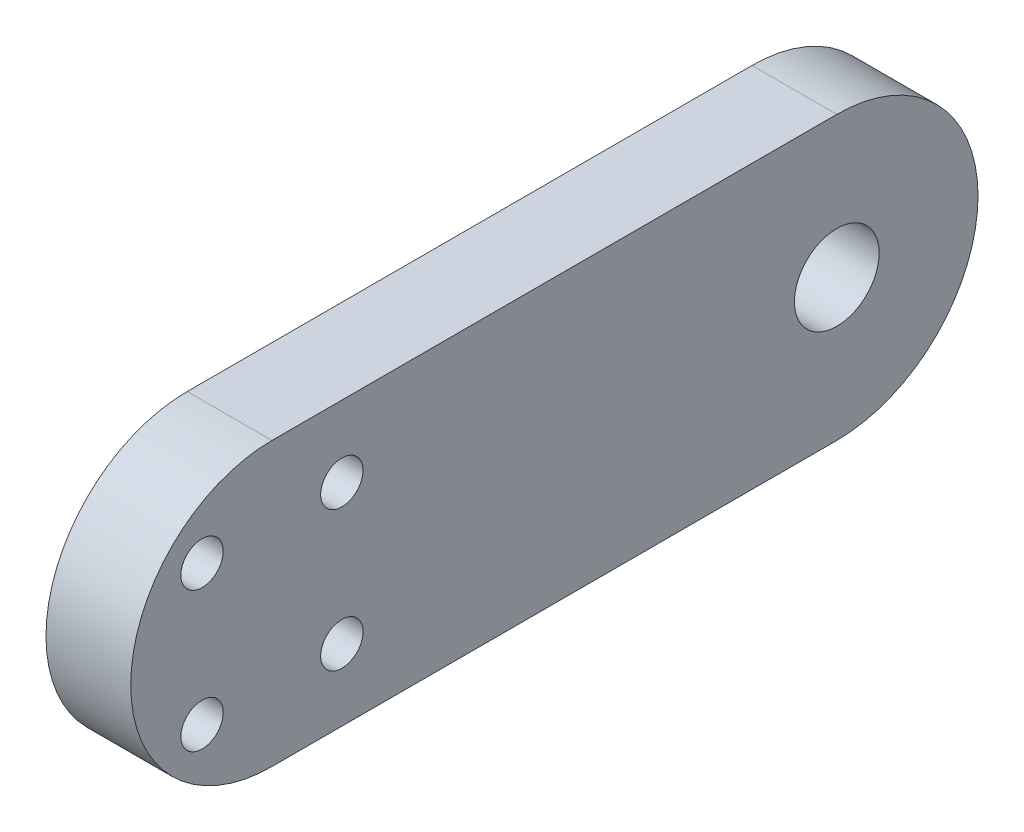
ISO-10303-21;
HEADER;
FILE_DESCRIPTION(('STEP AP214'),'2;1');
FILE_NAME('part.step','',(''),(''),'','','');
FILE_SCHEMA(('AUTOMOTIVE_DESIGN { 1 0 10303 214 1 1 1 1 }'));
ENDSEC;
DATA;
#1=APPLICATION_CONTEXT('core data for automotive mechanical design processes');
#2=APPLICATION_PROTOCOL_DEFINITION('international standard','automotive_design',2000,#1);
#3=PRODUCT_CONTEXT('',#1,'mechanical');
#4=PRODUCT('Part','Part','',(#3));
#5=PRODUCT_RELATED_PRODUCT_CATEGORY('part','',(#4));
#6=PRODUCT_DEFINITION_FORMATION('','',#4);
#7=PRODUCT_DEFINITION_CONTEXT('part definition',#1,'design');
#8=PRODUCT_DEFINITION('design','',#6,#7);
#9=PRODUCT_DEFINITION_SHAPE('','',#8);
#10=(LENGTH_UNIT() NAMED_UNIT(*) SI_UNIT(.MILLI.,.METRE.));
#11=(NAMED_UNIT(*) PLANE_ANGLE_UNIT() SI_UNIT($,.RADIAN.));
#12=(NAMED_UNIT(*) SI_UNIT($,.STERADIAN.) SOLID_ANGLE_UNIT());
#13=UNCERTAINTY_MEASURE_WITH_UNIT(LENGTH_MEASURE(1.E-05),#10,'distance_accuracy_value','');
#14=(GEOMETRIC_REPRESENTATION_CONTEXT(3) GLOBAL_UNCERTAINTY_ASSIGNED_CONTEXT((#13)) GLOBAL_UNIT_ASSIGNED_CONTEXT((#10,
#11,#12)) REPRESENTATION_CONTEXT('',''));
#15=CARTESIAN_POINT('',(0.,0.,0.));
#16=DIRECTION('',(0.,0.,1.));
#17=DIRECTION('',(1.,0.,0.));
#18=AXIS2_PLACEMENT_3D('',#15,#16,#17);
#19=CARTESIAN_POINT('',(3.,0.,-40.));
#20=DIRECTION('',(-1.,0.,0.));
#21=DIRECTION('',(0.,0.,1.));
#22=AXIS2_PLACEMENT_3D('',#19,#20,#21);
#23=CYLINDRICAL_SURFACE('',#22,10.);
#24=CARTESIAN_POINT('',(-3.,0.,-40.));
#25=DIRECTION('',(1.,0.,0.));
#26=DIRECTION('',(0.,0.,-1.));
#27=AXIS2_PLACEMENT_3D('',#24,#25,#26);
#28=CIRCLE('',#27,10.);
#29=CARTESIAN_POINT('',(-3.,-10.,-40.));
#30=VERTEX_POINT('',#29);
#31=CARTESIAN_POINT('',(-3.,10.,-40.));
#32=VERTEX_POINT('',#31);
#33=EDGE_CURVE('E104',#30,#32,#28,.T.);
#34=ORIENTED_EDGE('',*,*,#33,.T.);
#35=DIRECTION('',(-1.,0.,0.));
#36=VECTOR('',#35,1.);
#37=CARTESIAN_POINT('',(3.,10.,-40.));
#38=LINE('',#37,#36);
#39=CARTESIAN_POINT('',(3.,10.,-40.));
#40=VERTEX_POINT('',#39);
#41=EDGE_CURVE('E11',#40,#32,#38,.T.);
#42=ORIENTED_EDGE('',*,*,#41,.F.);
#43=CARTESIAN_POINT('',(3.,0.,-40.));
#44=DIRECTION('',(1.,0.,0.));
#45=DIRECTION('',(0.,0.,-1.));
#46=AXIS2_PLACEMENT_3D('',#43,#44,#45);
#47=CIRCLE('',#46,10.);
#48=CARTESIAN_POINT('',(3.,-10.,-40.));
#49=VERTEX_POINT('',#48);
#50=EDGE_CURVE('E90',#49,#40,#47,.T.);
#51=ORIENTED_EDGE('',*,*,#50,.F.);
#52=DIRECTION('',(-1.,0.,0.));
#53=VECTOR('',#52,1.);
#54=CARTESIAN_POINT('',(3.,-10.,-40.));
#55=LINE('',#54,#53);
#56=EDGE_CURVE('E57',#49,#30,#55,.T.);
#57=ORIENTED_EDGE('',*,*,#56,.T.);
#58=EDGE_LOOP('',(#34,#42,#51,#57));
#59=FACE_BOUND('',#58,.T.);
#60=ADVANCED_FACE('F41',(#59),#23,.T.);
#61=CARTESIAN_POINT('',(3.,10.,-40.));
#62=DIRECTION('',(0.,-1.,0.));
#63=DIRECTION('',(0.,0.,-1.));
#64=AXIS2_PLACEMENT_3D('',#61,#62,#63);
#65=PLANE('',#64);
#66=DIRECTION('',(0.,0.,1.));
#67=VECTOR('',#66,1.);
#68=CARTESIAN_POINT('',(-3.,10.,-40.));
#69=LINE('',#68,#67);
#70=CARTESIAN_POINT('',(-3.,9.99999999999999,0.));
#71=VERTEX_POINT('',#70);
#72=EDGE_CURVE('E95',#32,#71,#69,.T.);
#73=ORIENTED_EDGE('',*,*,#72,.T.);
#74=DIRECTION('',(-1.,0.,0.));
#75=VECTOR('',#74,1.);
#76=CARTESIAN_POINT('',(3.,9.99999999999999,0.));
#77=LINE('',#76,#75);
#78=CARTESIAN_POINT('',(3.,9.99999999999999,0.));
#79=VERTEX_POINT('',#78);
#80=EDGE_CURVE('E49',#79,#71,#77,.T.);
#81=ORIENTED_EDGE('',*,*,#80,.F.);
#82=DIRECTION('',(0.,0.,1.));
#83=VECTOR('',#82,1.);
#84=CARTESIAN_POINT('',(3.,10.,-40.));
#85=LINE('',#84,#83);
#86=EDGE_CURVE('E83',#40,#79,#85,.T.);
#87=ORIENTED_EDGE('',*,*,#86,.F.);
#88=ORIENTED_EDGE('',*,*,#41,.T.);
#89=EDGE_LOOP('',(#73,#81,#87,#88));
#90=FACE_BOUND('',#89,.T.);
#91=ADVANCED_FACE('F94',(#90),#65,.F.);
#92=CARTESIAN_POINT('',(3.,0.,0.));
#93=DIRECTION('',(-1.,0.,0.));
#94=DIRECTION('',(0.,0.,1.));
#95=AXIS2_PLACEMENT_3D('',#92,#93,#94);
#96=CYLINDRICAL_SURFACE('',#95,10.);
#97=CARTESIAN_POINT('',(-3.,0.,0.));
#98=DIRECTION('',(1.,0.,0.));
#99=DIRECTION('',(0.,0.,-1.));
#100=AXIS2_PLACEMENT_3D('',#97,#98,#99);
#101=CIRCLE('',#100,10.);
#102=CARTESIAN_POINT('',(-3.,-10.,0.));
#103=VERTEX_POINT('',#102);
#104=EDGE_CURVE('E108',#71,#103,#101,.T.);
#105=ORIENTED_EDGE('',*,*,#104,.T.);
#106=DIRECTION('',(-1.,0.,0.));
#107=VECTOR('',#106,1.);
#108=CARTESIAN_POINT('',(3.,-10.,0.));
#109=LINE('',#108,#107);
#110=CARTESIAN_POINT('',(3.,-10.,0.));
#111=VERTEX_POINT('',#110);
#112=EDGE_CURVE('E72',#111,#103,#109,.T.);
#113=ORIENTED_EDGE('',*,*,#112,.F.);
#114=CARTESIAN_POINT('',(3.,0.,0.));
#115=DIRECTION('',(1.,0.,0.));
#116=DIRECTION('',(0.,0.,-1.));
#117=AXIS2_PLACEMENT_3D('',#114,#115,#116);
#118=CIRCLE('',#117,10.);
#119=EDGE_CURVE('E89',#79,#111,#118,.T.);
#120=ORIENTED_EDGE('',*,*,#119,.F.);
#121=ORIENTED_EDGE('',*,*,#80,.T.);
#122=EDGE_LOOP('',(#105,#113,#120,#121));
#123=FACE_BOUND('',#122,.T.);
#124=ADVANCED_FACE('F98',(#123),#96,.T.);
#125=CARTESIAN_POINT('',(3.,-10.,-40.));
#126=DIRECTION('',(0.,-1.,0.));
#127=DIRECTION('',(0.,0.,-1.));
#128=AXIS2_PLACEMENT_3D('',#125,#126,#127);
#129=PLANE('',#128);
#130=DIRECTION('',(0.,0.,1.));
#131=VECTOR('',#130,1.);
#132=CARTESIAN_POINT('',(-3.,-10.,-40.));
#133=LINE('',#132,#131);
#134=EDGE_CURVE('E110',#30,#103,#133,.T.);
#135=ORIENTED_EDGE('',*,*,#134,.F.);
#136=ORIENTED_EDGE('',*,*,#56,.F.);
#137=DIRECTION('',(0.,0.,1.));
#138=VECTOR('',#137,1.);
#139=CARTESIAN_POINT('',(3.,-10.,-40.));
#140=LINE('',#139,#138);
#141=EDGE_CURVE('E99',#49,#111,#140,.T.);
#142=ORIENTED_EDGE('',*,*,#141,.T.);
#143=ORIENTED_EDGE('',*,*,#112,.T.);
#144=EDGE_LOOP('',(#135,#136,#142,#143));
#145=FACE_BOUND('',#144,.T.);
#146=ADVANCED_FACE('F151',(#145),#129,.T.);
#147=CARTESIAN_POINT('',(3.,0.,-40.));
#148=DIRECTION('',(1.,0.,0.));
#149=DIRECTION('',(0.,0.,-1.));
#150=AXIS2_PLACEMENT_3D('',#147,#148,#149);
#151=PLANE('',#150);
#152=CARTESIAN_POINT('',(3.,3.49373308061729E-11,-40.0000000000175));
#153=DIRECTION('',(1.,0.,0.));
#154=DIRECTION('',(0.,0.,-1.));
#155=AXIS2_PLACEMENT_3D('',#152,#153,#154);
#156=CIRCLE('',#155,2.99999999997308);
#157=CARTESIAN_POINT('',(3.,3.49373308061729E-11,-42.9999999999906));
#158=VERTEX_POINT('',#157);
#159=EDGE_CURVE('E142',#158,#158,#156,.T.);
#160=ORIENTED_EDGE('',*,*,#159,.F.);
#161=EDGE_LOOP('',(#160));
#162=FACE_BOUND('',#161,.T.);
#163=CARTESIAN_POINT('',(3.,4.9497474683061,4.94974746830557));
#164=DIRECTION('',(1.,0.,0.));
#165=DIRECTION('',(0.,0.,-1.));
#166=AXIS2_PLACEMENT_3D('',#163,#164,#165);
#167=CIRCLE('',#166,1.50000000000048);
#168=CARTESIAN_POINT('',(3.,4.9497474683061,3.44974746830508));
#169=VERTEX_POINT('',#168);
#170=EDGE_CURVE('E122',#169,#169,#167,.T.);
#171=ORIENTED_EDGE('',*,*,#170,.F.);
#172=EDGE_LOOP('',(#171));
#173=FACE_BOUND('',#172,.T.);
#174=CARTESIAN_POINT('',(3.,-4.94974746830556,4.94974746830585));
#175=DIRECTION('',(1.,0.,0.));
#176=DIRECTION('',(0.,0.,-1.));
#177=AXIS2_PLACEMENT_3D('',#174,#175,#176);
#178=CIRCLE('',#177,1.50000000000039);
#179=CARTESIAN_POINT('',(3.,-4.94974746830556,3.44974746830546));
#180=VERTEX_POINT('',#179);
#181=EDGE_CURVE('E130',#180,#180,#178,.T.);
#182=ORIENTED_EDGE('',*,*,#181,.F.);
#183=EDGE_LOOP('',(#182));
#184=FACE_BOUND('',#183,.T.);
#185=CARTESIAN_POINT('',(3.,-4.94974746830585,-4.94974746830582));
#186=DIRECTION('',(1.,0.,0.));
#187=DIRECTION('',(0.,0.,-1.));
#188=AXIS2_PLACEMENT_3D('',#185,#186,#187);
#189=CIRCLE('',#188,1.50000000000007);
#190=CARTESIAN_POINT('',(3.,-4.94974746830585,-6.44974746830589));
#191=VERTEX_POINT('',#190);
#192=EDGE_CURVE('E121',#191,#191,#189,.T.);
#193=ORIENTED_EDGE('',*,*,#192,.F.);
#194=EDGE_LOOP('',(#193));
#195=FACE_BOUND('',#194,.T.);
#196=CARTESIAN_POINT('',(3.,4.94974746830582,-4.9497474683061));
#197=DIRECTION('',(1.,0.,0.));
#198=DIRECTION('',(0.,0.,-1.));
#199=AXIS2_PLACEMENT_3D('',#196,#197,#198);
#200=CIRCLE('',#199,1.50000000000024);
#201=CARTESIAN_POINT('',(3.,4.94974746830582,-6.44974746830634));
#202=VERTEX_POINT('',#201);
#203=EDGE_CURVE('E118',#202,#202,#200,.T.);
#204=ORIENTED_EDGE('',*,*,#203,.F.);
#205=EDGE_LOOP('',(#204));
#206=FACE_BOUND('',#205,.T.);
#207=ORIENTED_EDGE('',*,*,#50,.T.);
#208=ORIENTED_EDGE('',*,*,#86,.T.);
#209=ORIENTED_EDGE('',*,*,#119,.T.);
#210=ORIENTED_EDGE('',*,*,#141,.F.);
#211=EDGE_LOOP('',(#207,#208,#209,#210));
#212=FACE_BOUND('',#211,.T.);
#213=ADVANCED_FACE('F86',(#162,#173,#184,#195,#206,#212),#151,.T.);
#214=CARTESIAN_POINT('',(-3.,0.,-40.));
#215=DIRECTION('',(1.,0.,0.));
#216=DIRECTION('',(0.,0.,-1.));
#217=AXIS2_PLACEMENT_3D('',#214,#215,#216);
#218=PLANE('',#217);
#219=CARTESIAN_POINT('',(-3.,3.49373308061729E-11,-40.0000000000175));
#220=DIRECTION('',(1.,0.,0.));
#221=DIRECTION('',(0.,0.,-1.));
#222=AXIS2_PLACEMENT_3D('',#219,#220,#221);
#223=CIRCLE('',#222,2.99999999997308);
#224=CARTESIAN_POINT('',(-3.,3.49373308061729E-11,-42.9999999999906));
#225=VERTEX_POINT('',#224);
#226=EDGE_CURVE('E129',#225,#225,#223,.T.);
#227=ORIENTED_EDGE('',*,*,#226,.T.);
#228=EDGE_LOOP('',(#227));
#229=FACE_BOUND('',#228,.T.);
#230=CARTESIAN_POINT('',(-3.,4.9497474683061,4.94974746830557));
#231=DIRECTION('',(1.,0.,0.));
#232=DIRECTION('',(0.,0.,-1.));
#233=AXIS2_PLACEMENT_3D('',#230,#231,#232);
#234=CIRCLE('',#233,1.50000000000048);
#235=CARTESIAN_POINT('',(-3.,4.9497474683061,3.44974746830508));
#236=VERTEX_POINT('',#235);
#237=EDGE_CURVE('E126',#236,#236,#234,.T.);
#238=ORIENTED_EDGE('',*,*,#237,.T.);
#239=EDGE_LOOP('',(#238));
#240=FACE_BOUND('',#239,.T.);
#241=CARTESIAN_POINT('',(-3.,-4.94974746830556,4.94974746830585));
#242=DIRECTION('',(1.,0.,0.));
#243=DIRECTION('',(0.,0.,-1.));
#244=AXIS2_PLACEMENT_3D('',#241,#242,#243);
#245=CIRCLE('',#244,1.50000000000039);
#246=CARTESIAN_POINT('',(-3.,-4.94974746830556,3.44974746830546));
#247=VERTEX_POINT('',#246);
#248=EDGE_CURVE('E125',#247,#247,#245,.T.);
#249=ORIENTED_EDGE('',*,*,#248,.T.);
#250=EDGE_LOOP('',(#249));
#251=FACE_BOUND('',#250,.T.);
#252=CARTESIAN_POINT('',(-3.,-4.94974746830585,-4.94974746830582));
#253=DIRECTION('',(1.,0.,0.));
#254=DIRECTION('',(0.,0.,-1.));
#255=AXIS2_PLACEMENT_3D('',#252,#253,#254);
#256=CIRCLE('',#255,1.50000000000007);
#257=CARTESIAN_POINT('',(-3.,-4.94974746830585,-6.44974746830589));
#258=VERTEX_POINT('',#257);
#259=EDGE_CURVE('E133',#258,#258,#256,.T.);
#260=ORIENTED_EDGE('',*,*,#259,.T.);
#261=EDGE_LOOP('',(#260));
#262=FACE_BOUND('',#261,.T.);
#263=CARTESIAN_POINT('',(-3.,4.94974746830582,-4.9497474683061));
#264=DIRECTION('',(1.,0.,0.));
#265=DIRECTION('',(0.,0.,-1.));
#266=AXIS2_PLACEMENT_3D('',#263,#264,#265);
#267=CIRCLE('',#266,1.50000000000024);
#268=CARTESIAN_POINT('',(-3.,4.94974746830582,-6.44974746830634));
#269=VERTEX_POINT('',#268);
#270=EDGE_CURVE('E106',#269,#269,#267,.T.);
#271=ORIENTED_EDGE('',*,*,#270,.T.);
#272=EDGE_LOOP('',(#271));
#273=FACE_BOUND('',#272,.T.);
#274=ORIENTED_EDGE('',*,*,#33,.F.);
#275=ORIENTED_EDGE('',*,*,#134,.T.);
#276=ORIENTED_EDGE('',*,*,#104,.F.);
#277=ORIENTED_EDGE('',*,*,#72,.F.);
#278=EDGE_LOOP('',(#274,#275,#276,#277));
#279=FACE_BOUND('',#278,.T.);
#280=ADVANCED_FACE('F150',(#229,#240,#251,#262,#273,#279),#218,.F.);
#281=CARTESIAN_POINT('',(-3.,4.94974746830582,-4.9497474683061));
#282=DIRECTION('',(1.,0.,0.));
#283=DIRECTION('',(0.,0.,-1.));
#284=AXIS2_PLACEMENT_3D('',#281,#282,#283);
#285=CYLINDRICAL_SURFACE('',#284,1.50000000000024);
#286=ORIENTED_EDGE('',*,*,#270,.F.);
#287=EDGE_LOOP('',(#286));
#288=FACE_BOUND('',#287,.T.);
#289=ORIENTED_EDGE('',*,*,#203,.T.);
#290=EDGE_LOOP('',(#289));
#291=FACE_BOUND('',#290,.T.);
#292=ADVANCED_FACE('F161',(#288,#291),#285,.F.);
#293=CARTESIAN_POINT('',(-3.,-4.94974746830585,-4.94974746830582));
#294=DIRECTION('',(1.,0.,0.));
#295=DIRECTION('',(0.,0.,-1.));
#296=AXIS2_PLACEMENT_3D('',#293,#294,#295);
#297=CYLINDRICAL_SURFACE('',#296,1.50000000000007);
#298=ORIENTED_EDGE('',*,*,#259,.F.);
#299=EDGE_LOOP('',(#298));
#300=FACE_BOUND('',#299,.T.);
#301=ORIENTED_EDGE('',*,*,#192,.T.);
#302=EDGE_LOOP('',(#301));
#303=FACE_BOUND('',#302,.T.);
#304=ADVANCED_FACE('F163',(#300,#303),#297,.F.);
#305=CARTESIAN_POINT('',(-3.,-4.94974746830556,4.94974746830585));
#306=DIRECTION('',(1.,0.,0.));
#307=DIRECTION('',(0.,0.,-1.));
#308=AXIS2_PLACEMENT_3D('',#305,#306,#307);
#309=CYLINDRICAL_SURFACE('',#308,1.50000000000039);
#310=ORIENTED_EDGE('',*,*,#248,.F.);
#311=EDGE_LOOP('',(#310));
#312=FACE_BOUND('',#311,.T.);
#313=ORIENTED_EDGE('',*,*,#181,.T.);
#314=EDGE_LOOP('',(#313));
#315=FACE_BOUND('',#314,.T.);
#316=ADVANCED_FACE('F170',(#312,#315),#309,.F.);
#317=CARTESIAN_POINT('',(-3.,4.9497474683061,4.94974746830557));
#318=DIRECTION('',(1.,0.,0.));
#319=DIRECTION('',(0.,0.,-1.));
#320=AXIS2_PLACEMENT_3D('',#317,#318,#319);
#321=CYLINDRICAL_SURFACE('',#320,1.50000000000048);
#322=ORIENTED_EDGE('',*,*,#237,.F.);
#323=EDGE_LOOP('',(#322));
#324=FACE_BOUND('',#323,.T.);
#325=ORIENTED_EDGE('',*,*,#170,.T.);
#326=EDGE_LOOP('',(#325));
#327=FACE_BOUND('',#326,.T.);
#328=ADVANCED_FACE('F231',(#324,#327),#321,.F.);
#329=CARTESIAN_POINT('',(-3.,3.49373308061729E-11,-40.0000000000175));
#330=DIRECTION('',(1.,0.,0.));
#331=DIRECTION('',(0.,0.,-1.));
#332=AXIS2_PLACEMENT_3D('',#329,#330,#331);
#333=CYLINDRICAL_SURFACE('',#332,2.99999999997308);
#334=ORIENTED_EDGE('',*,*,#226,.F.);
#335=EDGE_LOOP('',(#334));
#336=FACE_BOUND('',#335,.T.);
#337=ORIENTED_EDGE('',*,*,#159,.T.);
#338=EDGE_LOOP('',(#337));
#339=FACE_BOUND('',#338,.T.);
#340=ADVANCED_FACE('F146',(#336,#339),#333,.F.);
#341=CLOSED_SHELL('',(#60,#91,#124,#146,#213,#280,#292,#304,#316,#328,#340));
#342=MANIFOLD_SOLID_BREP('B2',#341);
#343=ADVANCED_BREP_SHAPE_REPRESENTATION('',(#18,#342),#14);
#344=SHAPE_DEFINITION_REPRESENTATION(#9,#343);
ENDSEC;
END-ISO-10303-21;
